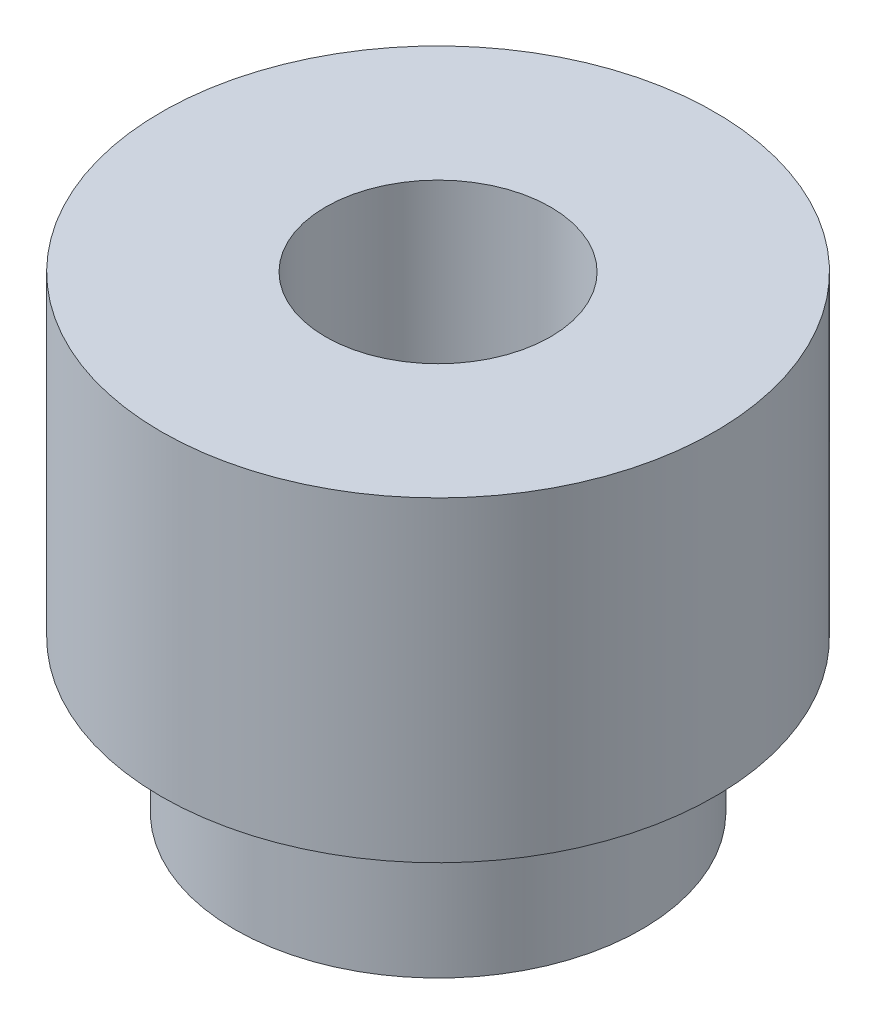
ISO-10303-21;
HEADER;
FILE_DESCRIPTION(('STEP AP214'),'2;1');
FILE_NAME('part.step','',(''),(''),'','','');
FILE_SCHEMA(('AUTOMOTIVE_DESIGN { 1 0 10303 214 1 1 1 1 }'));
ENDSEC;
DATA;
#1=APPLICATION_CONTEXT('core data for automotive mechanical design processes');
#2=APPLICATION_PROTOCOL_DEFINITION('international standard','automotive_design',2000,#1);
#3=PRODUCT_CONTEXT('',#1,'mechanical');
#4=PRODUCT('Part','Part','',(#3));
#5=PRODUCT_RELATED_PRODUCT_CATEGORY('part','',(#4));
#6=PRODUCT_DEFINITION_FORMATION('','',#4);
#7=PRODUCT_DEFINITION_CONTEXT('part definition',#1,'design');
#8=PRODUCT_DEFINITION('design','',#6,#7);
#9=PRODUCT_DEFINITION_SHAPE('','',#8);
#10=(LENGTH_UNIT() NAMED_UNIT(*) SI_UNIT(.MILLI.,.METRE.));
#11=(NAMED_UNIT(*) PLANE_ANGLE_UNIT() SI_UNIT($,.RADIAN.));
#12=(NAMED_UNIT(*) SI_UNIT($,.STERADIAN.) SOLID_ANGLE_UNIT());
#13=UNCERTAINTY_MEASURE_WITH_UNIT(LENGTH_MEASURE(1.E-05),#10,'distance_accuracy_value','');
#14=(GEOMETRIC_REPRESENTATION_CONTEXT(3) GLOBAL_UNCERTAINTY_ASSIGNED_CONTEXT((#13)) GLOBAL_UNIT_ASSIGNED_CONTEXT((#10,
#11,#12)) REPRESENTATION_CONTEXT('',''));
#15=CARTESIAN_POINT('',(0.,0.,0.));
#16=DIRECTION('',(0.,0.,1.));
#17=DIRECTION('',(1.,0.,0.));
#18=AXIS2_PLACEMENT_3D('',#15,#16,#17);
#19=CARTESIAN_POINT('',(0.,1.524,0.));
#20=DIRECTION('',(0.,-1.,0.));
#21=DIRECTION('',(0.,0.,-1.));
#22=AXIS2_PLACEMENT_3D('',#19,#20,#21);
#23=CYLINDRICAL_SURFACE('',#22,2.045);
#24=CARTESIAN_POINT('',(0.,1.524,0.));
#25=DIRECTION('',(0.,1.,0.));
#26=DIRECTION('',(0.,0.,1.));
#27=AXIS2_PLACEMENT_3D('',#24,#25,#26);
#28=CIRCLE('',#27,2.045);
#29=CARTESIAN_POINT('',(0.,1.524,2.045));
#30=VERTEX_POINT('',#29);
#31=EDGE_CURVE('E10',#30,#30,#28,.T.);
#32=ORIENTED_EDGE('',*,*,#31,.F.);
#33=EDGE_LOOP('',(#32));
#34=FACE_BOUND('',#33,.T.);
#35=CARTESIAN_POINT('',(0.,0.,0.));
#36=DIRECTION('',(0.,1.,0.));
#37=DIRECTION('',(0.,0.,1.));
#38=AXIS2_PLACEMENT_3D('',#35,#36,#37);
#39=CIRCLE('',#38,2.045);
#40=CARTESIAN_POINT('',(0.,0.,2.045));
#41=VERTEX_POINT('',#40);
#42=EDGE_CURVE('E44',#41,#41,#39,.T.);
#43=ORIENTED_EDGE('',*,*,#42,.T.);
#44=EDGE_LOOP('',(#43));
#45=FACE_BOUND('',#44,.T.);
#46=ADVANCED_FACE('F41',(#34,#45),#23,.T.);
#47=CARTESIAN_POINT('',(0.,0.,0.));
#48=DIRECTION('',(0.,1.,0.));
#49=DIRECTION('',(0.,0.,1.));
#50=AXIS2_PLACEMENT_3D('',#47,#48,#49);
#51=PLANE('',#50);
#52=CARTESIAN_POINT('',(0.,0.,0.));
#53=DIRECTION('',(0.,1.,0.));
#54=DIRECTION('',(0.,0.,1.));
#55=AXIS2_PLACEMENT_3D('',#52,#53,#54);
#56=CIRCLE('',#55,1.13029999999999);
#57=CARTESIAN_POINT('',(0.,0.,1.13029999999999));
#58=VERTEX_POINT('',#57);
#59=EDGE_CURVE('E59',#58,#58,#56,.T.);
#60=ORIENTED_EDGE('',*,*,#59,.T.);
#61=EDGE_LOOP('',(#60));
#62=FACE_BOUND('',#61,.T.);
#63=ORIENTED_EDGE('',*,*,#42,.F.);
#64=EDGE_LOOP('',(#63));
#65=FACE_BOUND('',#64,.T.);
#66=ADVANCED_FACE('F84',(#62,#65),#51,.F.);
#67=CARTESIAN_POINT('',(0.,4.699,0.));
#68=DIRECTION('',(0.,-1.,0.));
#69=DIRECTION('',(0.,0.,-1.));
#70=AXIS2_PLACEMENT_3D('',#67,#68,#69);
#71=CYLINDRICAL_SURFACE('',#70,2.7813);
#72=CARTESIAN_POINT('',(0.,4.699,0.));
#73=DIRECTION('',(0.,1.,0.));
#74=DIRECTION('',(0.,0.,1.));
#75=AXIS2_PLACEMENT_3D('',#72,#73,#74);
#76=CIRCLE('',#75,2.7813);
#77=CARTESIAN_POINT('',(0.,4.699,2.7813));
#78=VERTEX_POINT('',#77);
#79=EDGE_CURVE('E53',#78,#78,#76,.T.);
#80=ORIENTED_EDGE('',*,*,#79,.F.);
#81=EDGE_LOOP('',(#80));
#82=FACE_BOUND('',#81,.T.);
#83=CARTESIAN_POINT('',(0.,1.524,0.));
#84=DIRECTION('',(0.,1.,0.));
#85=DIRECTION('',(0.,0.,1.));
#86=AXIS2_PLACEMENT_3D('',#83,#84,#85);
#87=CIRCLE('',#86,2.7813);
#88=CARTESIAN_POINT('',(0.,1.524,2.7813));
#89=VERTEX_POINT('',#88);
#90=EDGE_CURVE('E55',#89,#89,#87,.T.);
#91=ORIENTED_EDGE('',*,*,#90,.T.);
#92=EDGE_LOOP('',(#91));
#93=FACE_BOUND('',#92,.T.);
#94=ADVANCED_FACE('F78',(#82,#93),#71,.T.);
#95=CARTESIAN_POINT('',(0.,4.699,0.));
#96=DIRECTION('',(0.,1.,0.));
#97=DIRECTION('',(0.,0.,1.));
#98=AXIS2_PLACEMENT_3D('',#95,#96,#97);
#99=PLANE('',#98);
#100=CARTESIAN_POINT('',(0.,4.699,0.));
#101=DIRECTION('',(0.,1.,0.));
#102=DIRECTION('',(0.,0.,1.));
#103=AXIS2_PLACEMENT_3D('',#100,#101,#102);
#104=CIRCLE('',#103,1.13029999999999);
#105=CARTESIAN_POINT('',(0.,4.699,1.13029999999999));
#106=VERTEX_POINT('',#105);
#107=EDGE_CURVE('E66',#106,#106,#104,.T.);
#108=ORIENTED_EDGE('',*,*,#107,.F.);
#109=EDGE_LOOP('',(#108));
#110=FACE_BOUND('',#109,.T.);
#111=ORIENTED_EDGE('',*,*,#79,.T.);
#112=EDGE_LOOP('',(#111));
#113=FACE_BOUND('',#112,.T.);
#114=ADVANCED_FACE('F74',(#110,#113),#99,.T.);
#115=CARTESIAN_POINT('',(0.,1.524,0.));
#116=DIRECTION('',(0.,1.,0.));
#117=DIRECTION('',(0.,0.,1.));
#118=AXIS2_PLACEMENT_3D('',#115,#116,#117);
#119=PLANE('',#118);
#120=ORIENTED_EDGE('',*,*,#31,.T.);
#121=EDGE_LOOP('',(#120));
#122=FACE_BOUND('',#121,.T.);
#123=ORIENTED_EDGE('',*,*,#90,.F.);
#124=EDGE_LOOP('',(#123));
#125=FACE_BOUND('',#124,.T.);
#126=ADVANCED_FACE('F77',(#122,#125),#119,.F.);
#127=CARTESIAN_POINT('',(0.,4.699,0.));
#128=DIRECTION('',(0.,1.,0.));
#129=DIRECTION('',(0.,0.,1.));
#130=AXIS2_PLACEMENT_3D('',#127,#128,#129);
#131=CYLINDRICAL_SURFACE('',#130,1.13029999999999);
#132=ORIENTED_EDGE('',*,*,#107,.T.);
#133=EDGE_LOOP('',(#132));
#134=FACE_BOUND('',#133,.T.);
#135=ORIENTED_EDGE('',*,*,#59,.F.);
#136=EDGE_LOOP('',(#135));
#137=FACE_BOUND('',#136,.T.);
#138=ADVANCED_FACE('F71',(#134,#137),#131,.F.);
#139=CLOSED_SHELL('',(#46,#66,#94,#114,#126,#138));
#140=MANIFOLD_SOLID_BREP('B2',#139);
#141=ADVANCED_BREP_SHAPE_REPRESENTATION('',(#18,#140),#14);
#142=SHAPE_DEFINITION_REPRESENTATION(#9,#141);
ENDSEC;
END-ISO-10303-21;
